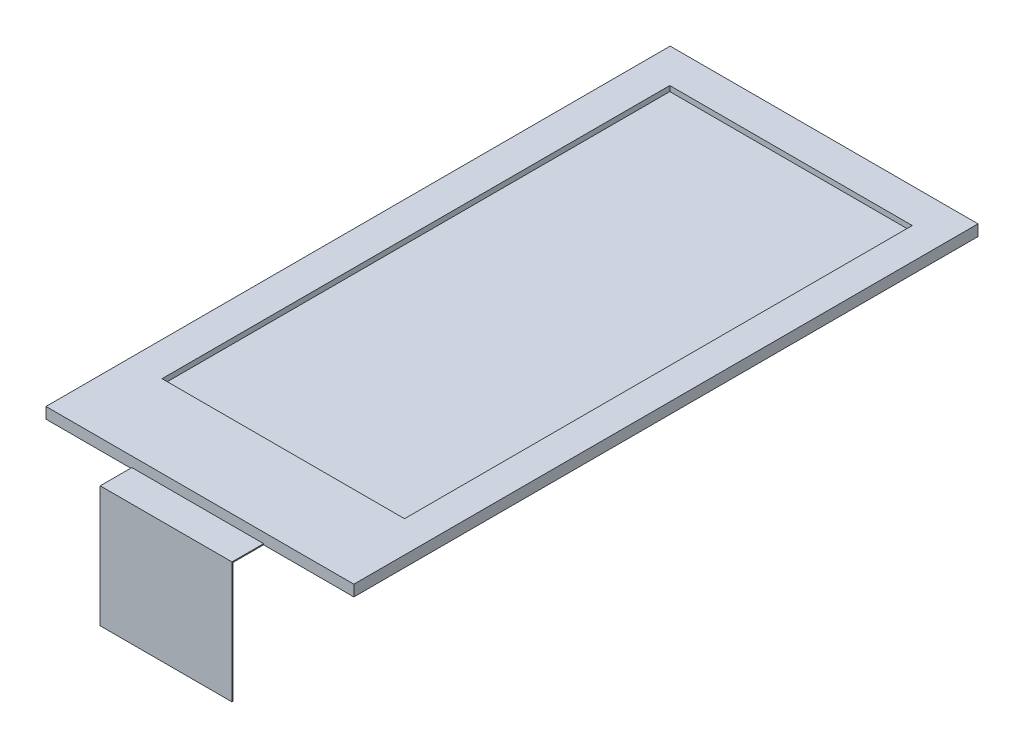
ISO-10303-21;
HEADER;
FILE_DESCRIPTION(('STEP AP214'),'2;1');
FILE_NAME('part.step','',(''),(''),'','','');
FILE_SCHEMA(('AUTOMOTIVE_DESIGN { 1 0 10303 214 1 1 1 1 }'));
ENDSEC;
DATA;
#1=APPLICATION_CONTEXT('core data for automotive mechanical design processes');
#2=APPLICATION_PROTOCOL_DEFINITION('international standard','automotive_design',2000,#1);
#3=PRODUCT_CONTEXT('',#1,'mechanical');
#4=PRODUCT('Part','Part','',(#3));
#5=PRODUCT_RELATED_PRODUCT_CATEGORY('part','',(#4));
#6=PRODUCT_DEFINITION_FORMATION('','',#4);
#7=PRODUCT_DEFINITION_CONTEXT('part definition',#1,'design');
#8=PRODUCT_DEFINITION('design','',#6,#7);
#9=PRODUCT_DEFINITION_SHAPE('','',#8);
#10=(LENGTH_UNIT() NAMED_UNIT(*) SI_UNIT(.MILLI.,.METRE.));
#11=(NAMED_UNIT(*) PLANE_ANGLE_UNIT() SI_UNIT($,.RADIAN.));
#12=(NAMED_UNIT(*) SI_UNIT($,.STERADIAN.) SOLID_ANGLE_UNIT());
#13=UNCERTAINTY_MEASURE_WITH_UNIT(LENGTH_MEASURE(1.E-05),#10,'distance_accuracy_value','');
#14=(GEOMETRIC_REPRESENTATION_CONTEXT(3) GLOBAL_UNCERTAINTY_ASSIGNED_CONTEXT((#13)) GLOBAL_UNIT_ASSIGNED_CONTEXT((#10,
#11,#12)) REPRESENTATION_CONTEXT('',''));
#15=CARTESIAN_POINT('',(0.,0.,0.));
#16=DIRECTION('',(0.,0.,1.));
#17=DIRECTION('',(1.,0.,0.));
#18=AXIS2_PLACEMENT_3D('',#15,#16,#17);
#19=CARTESIAN_POINT('',(0.,1.6,0.));
#20=DIRECTION('',(0.,-1.,0.));
#21=DIRECTION('',(0.,0.,-1.));
#22=AXIS2_PLACEMENT_3D('',#19,#20,#21);
#23=PLANE('',#22);
#24=DIRECTION('',(0.,0.,1.));
#25=VECTOR('',#24,1.);
#26=CARTESIAN_POINT('',(8.64,1.6,62.1));
#27=LINE('',#26,#25);
#28=CARTESIAN_POINT('',(8.64,1.6,62.1));
#29=VERTEX_POINT('',#28);
#30=CARTESIAN_POINT('',(8.64,1.6,65.1));
#31=VERTEX_POINT('',#30);
#32=EDGE_CURVE('E204',#29,#31,#27,.T.);
#33=ORIENTED_EDGE('',*,*,#32,.T.);
#34=DIRECTION('',(1.,0.,0.));
#35=VECTOR('',#34,1.);
#36=CARTESIAN_POINT('',(0.,1.6,65.1));
#37=LINE('',#36,#35);
#38=CARTESIAN_POINT('',(21.14,1.6,65.1));
#39=VERTEX_POINT('',#38);
#40=EDGE_CURVE('E179',#31,#39,#37,.T.);
#41=ORIENTED_EDGE('',*,*,#40,.T.);
#42=DIRECTION('',(0.,0.,-1.));
#43=VECTOR('',#42,1.);
#44=CARTESIAN_POINT('',(21.14,1.6,62.1));
#45=LINE('',#44,#43);
#46=CARTESIAN_POINT('',(21.14,1.6,62.1));
#47=VERTEX_POINT('',#46);
#48=EDGE_CURVE('E58',#39,#47,#45,.T.);
#49=ORIENTED_EDGE('',*,*,#48,.T.);
#50=DIRECTION('',(-1.,0.,0.));
#51=VECTOR('',#50,1.);
#52=CARTESIAN_POINT('',(21.14,1.6,62.1));
#53=LINE('',#52,#51);
#54=EDGE_CURVE('E201',#47,#29,#53,.T.);
#55=ORIENTED_EDGE('',*,*,#54,.T.);
#56=EDGE_LOOP('',(#33,#41,#49,#55));
#57=FACE_BOUND('',#56,.T.);
#58=ADVANCED_FACE('F35',(#57),#23,.F.);
#59=CARTESIAN_POINT('',(0.499999999999999,2.55,62.1));
#60=DIRECTION('',(0.,0.,-1.));
#61=DIRECTION('',(-1.,0.,0.));
#62=AXIS2_PLACEMENT_3D('',#59,#60,#61);
#63=PLANE('',#62);
#64=DIRECTION('',(0.,-1.,0.));
#65=VECTOR('',#64,1.);
#66=CARTESIAN_POINT('',(21.14,1.6,62.1));
#67=LINE('',#66,#65);
#68=CARTESIAN_POINT('',(21.14,1.5,62.1));
#69=VERTEX_POINT('',#68);
#70=EDGE_CURVE('E214',#47,#69,#67,.T.);
#71=ORIENTED_EDGE('',*,*,#70,.T.);
#72=DIRECTION('',(1.,0.,0.));
#73=VECTOR('',#72,1.);
#74=CARTESIAN_POINT('',(0.499999999999999,1.5,62.1));
#75=LINE('',#74,#73);
#76=CARTESIAN_POINT('',(29.7,1.5,62.1));
#77=VERTEX_POINT('',#76);
#78=EDGE_CURVE('E231',#69,#77,#75,.T.);
#79=ORIENTED_EDGE('',*,*,#78,.T.);
#80=DIRECTION('',(0.,-1.,0.));
#81=VECTOR('',#80,1.);
#82=CARTESIAN_POINT('',(29.7,2.55,62.1));
#83=LINE('',#82,#81);
#84=CARTESIAN_POINT('',(29.7,2.55,62.1));
#85=VERTEX_POINT('',#84);
#86=EDGE_CURVE('E43',#85,#77,#83,.T.);
#87=ORIENTED_EDGE('',*,*,#86,.F.);
#88=DIRECTION('',(1.,0.,0.));
#89=VECTOR('',#88,1.);
#90=CARTESIAN_POINT('',(0.499999999999999,2.55,62.1));
#91=LINE('',#90,#89);
#92=CARTESIAN_POINT('',(0.499999999999999,2.55,62.1));
#93=VERTEX_POINT('',#92);
#94=EDGE_CURVE('E221',#93,#85,#91,.T.);
#95=ORIENTED_EDGE('',*,*,#94,.F.);
#96=DIRECTION('',(0.,-1.,0.));
#97=VECTOR('',#96,1.);
#98=CARTESIAN_POINT('',(0.499999999999999,2.55,62.1));
#99=LINE('',#98,#97);
#100=CARTESIAN_POINT('',(0.499999999999999,1.5,62.1));
#101=VERTEX_POINT('',#100);
#102=EDGE_CURVE('E11',#93,#101,#99,.T.);
#103=ORIENTED_EDGE('',*,*,#102,.T.);
#104=CARTESIAN_POINT('',(8.64,1.5,62.1));
#105=VERTEX_POINT('',#104);
#106=EDGE_CURVE('E232',#101,#105,#75,.T.);
#107=ORIENTED_EDGE('',*,*,#106,.T.);
#108=DIRECTION('',(0.,-1.,0.));
#109=VECTOR('',#108,1.);
#110=CARTESIAN_POINT('',(8.64,1.6,62.1));
#111=LINE('',#110,#109);
#112=EDGE_CURVE('E207',#29,#105,#111,.T.);
#113=ORIENTED_EDGE('',*,*,#112,.F.);
#114=ORIENTED_EDGE('',*,*,#54,.F.);
#115=EDGE_LOOP('',(#71,#79,#87,#95,#103,#107,#113,#114));
#116=FACE_BOUND('',#115,.T.);
#117=ADVANCED_FACE('F252',(#116),#63,.F.);
#118=CARTESIAN_POINT('',(0.499999999999995,2.55,2.9));
#119=DIRECTION('',(1.,0.,0.));
#120=DIRECTION('',(0.,0.,-1.));
#121=AXIS2_PLACEMENT_3D('',#118,#119,#120);
#122=PLANE('',#121);
#123=DIRECTION('',(0.,0.,1.));
#124=VECTOR('',#123,1.);
#125=CARTESIAN_POINT('',(0.499999999999995,1.5,2.9));
#126=LINE('',#125,#124);
#127=CARTESIAN_POINT('',(0.499999999999995,1.5,2.9));
#128=VERTEX_POINT('',#127);
#129=EDGE_CURVE('E217',#128,#101,#126,.T.);
#130=ORIENTED_EDGE('',*,*,#129,.T.);
#131=ORIENTED_EDGE('',*,*,#102,.F.);
#132=DIRECTION('',(0.,0.,1.));
#133=VECTOR('',#132,1.);
#134=CARTESIAN_POINT('',(0.499999999999995,2.55,2.9));
#135=LINE('',#134,#133);
#136=CARTESIAN_POINT('',(0.499999999999995,2.55,2.9));
#137=VERTEX_POINT('',#136);
#138=EDGE_CURVE('E218',#137,#93,#135,.T.);
#139=ORIENTED_EDGE('',*,*,#138,.F.);
#140=DIRECTION('',(0.,-1.,0.));
#141=VECTOR('',#140,1.);
#142=CARTESIAN_POINT('',(0.499999999999995,2.55,2.9));
#143=LINE('',#142,#141);
#144=EDGE_CURVE('E228',#137,#128,#143,.T.);
#145=ORIENTED_EDGE('',*,*,#144,.T.);
#146=EDGE_LOOP('',(#130,#131,#139,#145));
#147=FACE_BOUND('',#146,.T.);
#148=ADVANCED_FACE('F37',(#147),#122,.F.);
#149=CARTESIAN_POINT('',(29.7,2.55,2.9));
#150=DIRECTION('',(-1.,0.,0.));
#151=DIRECTION('',(0.,0.,1.));
#152=AXIS2_PLACEMENT_3D('',#149,#150,#151);
#153=PLANE('',#152);
#154=DIRECTION('',(0.,0.,-1.));
#155=VECTOR('',#154,1.);
#156=CARTESIAN_POINT('',(29.7,1.5,2.9));
#157=LINE('',#156,#155);
#158=CARTESIAN_POINT('',(29.7,1.5,2.9));
#159=VERTEX_POINT('',#158);
#160=EDGE_CURVE('E235',#77,#159,#157,.T.);
#161=ORIENTED_EDGE('',*,*,#160,.T.);
#162=DIRECTION('',(0.,-1.,0.));
#163=VECTOR('',#162,1.);
#164=CARTESIAN_POINT('',(29.7,2.55,2.9));
#165=LINE('',#164,#163);
#166=CARTESIAN_POINT('',(29.7,2.55,2.9));
#167=VERTEX_POINT('',#166);
#168=EDGE_CURVE('E242',#167,#159,#165,.T.);
#169=ORIENTED_EDGE('',*,*,#168,.F.);
#170=DIRECTION('',(0.,0.,-1.));
#171=VECTOR('',#170,1.);
#172=CARTESIAN_POINT('',(29.7,2.55,2.9));
#173=LINE('',#172,#171);
#174=EDGE_CURVE('E224',#85,#167,#173,.T.);
#175=ORIENTED_EDGE('',*,*,#174,.F.);
#176=ORIENTED_EDGE('',*,*,#86,.T.);
#177=EDGE_LOOP('',(#161,#169,#175,#176));
#178=FACE_BOUND('',#177,.T.);
#179=ADVANCED_FACE('F248',(#178),#153,.F.);
#180=CARTESIAN_POINT('',(0.499999999999995,2.55,2.9));
#181=DIRECTION('',(0.,0.,1.));
#182=DIRECTION('',(1.,0.,0.));
#183=AXIS2_PLACEMENT_3D('',#180,#181,#182);
#184=PLANE('',#183);
#185=DIRECTION('',(-1.,0.,0.));
#186=VECTOR('',#185,1.);
#187=CARTESIAN_POINT('',(0.499999999999995,1.5,2.9));
#188=LINE('',#187,#186);
#189=EDGE_CURVE('E222',#159,#128,#188,.T.);
#190=ORIENTED_EDGE('',*,*,#189,.T.);
#191=ORIENTED_EDGE('',*,*,#144,.F.);
#192=DIRECTION('',(-1.,0.,0.));
#193=VECTOR('',#192,1.);
#194=CARTESIAN_POINT('',(0.499999999999995,2.55,2.9));
#195=LINE('',#194,#193);
#196=EDGE_CURVE('E226',#167,#137,#195,.T.);
#197=ORIENTED_EDGE('',*,*,#196,.F.);
#198=ORIENTED_EDGE('',*,*,#168,.T.);
#199=EDGE_LOOP('',(#190,#191,#197,#198));
#200=FACE_BOUND('',#199,.T.);
#201=ADVANCED_FACE('F261',(#200),#184,.F.);
#202=CARTESIAN_POINT('',(0.,2.55,0.));
#203=DIRECTION('',(0.,1.,0.));
#204=DIRECTION('',(0.,0.,1.));
#205=AXIS2_PLACEMENT_3D('',#202,#203,#204);
#206=PLANE('',#205);
#207=DIRECTION('',(0.,0.,1.));
#208=VECTOR('',#207,1.);
#209=CARTESIAN_POINT('',(3.72170232398616,2.55,54.3176233946099));
#210=LINE('',#209,#208);
#211=CARTESIAN_POINT('',(3.72170232398616,2.55,6.15565598195644));
#212=VERTEX_POINT('',#211);
#213=CARTESIAN_POINT('',(3.72170232398616,2.55,54.3176233946099));
#214=VERTEX_POINT('',#213);
#215=EDGE_CURVE('E50',#212,#214,#210,.T.);
#216=ORIENTED_EDGE('',*,*,#215,.F.);
#217=DIRECTION('',(-1.,0.,0.));
#218=VECTOR('',#217,1.);
#219=CARTESIAN_POINT('',(3.72170232398616,2.55,6.15565598195644));
#220=LINE('',#219,#218);
#221=CARTESIAN_POINT('',(26.7226222247245,2.55,6.15565598195644));
#222=VERTEX_POINT('',#221);
#223=EDGE_CURVE('E158',#222,#212,#220,.T.);
#224=ORIENTED_EDGE('',*,*,#223,.F.);
#225=DIRECTION('',(0.,0.,-1.));
#226=VECTOR('',#225,1.);
#227=CARTESIAN_POINT('',(26.7226222247245,2.55,54.3176233946099));
#228=LINE('',#227,#226);
#229=CARTESIAN_POINT('',(26.7226222247245,2.55,54.3176233946099));
#230=VERTEX_POINT('',#229);
#231=EDGE_CURVE('E161',#230,#222,#228,.T.);
#232=ORIENTED_EDGE('',*,*,#231,.F.);
#233=DIRECTION('',(1.,0.,0.));
#234=VECTOR('',#233,1.);
#235=CARTESIAN_POINT('',(3.72170232398616,2.55,54.3176233946099));
#236=LINE('',#235,#234);
#237=EDGE_CURVE('E167',#214,#230,#236,.T.);
#238=ORIENTED_EDGE('',*,*,#237,.F.);
#239=EDGE_LOOP('',(#216,#224,#232,#238));
#240=FACE_BOUND('',#239,.T.);
#241=ORIENTED_EDGE('',*,*,#138,.T.);
#242=ORIENTED_EDGE('',*,*,#94,.T.);
#243=ORIENTED_EDGE('',*,*,#174,.T.);
#244=ORIENTED_EDGE('',*,*,#196,.T.);
#245=EDGE_LOOP('',(#241,#242,#243,#244));
#246=FACE_BOUND('',#245,.T.);
#247=ADVANCED_FACE('F264',(#240,#246),#206,.T.);
#248=CARTESIAN_POINT('',(21.14,1.6,62.1));
#249=DIRECTION('',(-1.,0.,0.));
#250=DIRECTION('',(0.,0.,1.));
#251=AXIS2_PLACEMENT_3D('',#248,#249,#250);
#252=PLANE('',#251);
#253=ORIENTED_EDGE('',*,*,#48,.F.);
#254=DIRECTION('',(0.,1.,0.));
#255=VECTOR('',#254,1.);
#256=CARTESIAN_POINT('',(21.14,1.5,65.1));
#257=LINE('',#256,#255);
#258=CARTESIAN_POINT('',(21.14,-9.9,65.1));
#259=VERTEX_POINT('',#258);
#260=EDGE_CURVE('E182',#259,#39,#257,.T.);
#261=ORIENTED_EDGE('',*,*,#260,.F.);
#262=DIRECTION('',(0.,0.,-1.));
#263=VECTOR('',#262,1.);
#264=CARTESIAN_POINT('',(21.14,-9.9,65.1));
#265=LINE('',#264,#263);
#266=CARTESIAN_POINT('',(21.14,-9.9,65.));
#267=VERTEX_POINT('',#266);
#268=EDGE_CURVE('E189',#259,#267,#265,.T.);
#269=ORIENTED_EDGE('',*,*,#268,.T.);
#270=DIRECTION('',(0.,1.,0.));
#271=VECTOR('',#270,1.);
#272=CARTESIAN_POINT('',(21.14,1.5,65.));
#273=LINE('',#272,#271);
#274=CARTESIAN_POINT('',(21.14,1.5,65.));
#275=VERTEX_POINT('',#274);
#276=EDGE_CURVE('E181',#267,#275,#273,.T.);
#277=ORIENTED_EDGE('',*,*,#276,.T.);
#278=DIRECTION('',(0.,0.,-1.));
#279=VECTOR('',#278,1.);
#280=CARTESIAN_POINT('',(21.14,1.5,62.1));
#281=LINE('',#280,#279);
#282=EDGE_CURVE('E199',#275,#69,#281,.T.);
#283=ORIENTED_EDGE('',*,*,#282,.T.);
#284=ORIENTED_EDGE('',*,*,#70,.F.);
#285=EDGE_LOOP('',(#253,#261,#269,#277,#283,#284));
#286=FACE_BOUND('',#285,.T.);
#287=ADVANCED_FACE('F273',(#286),#252,.F.);
#288=CARTESIAN_POINT('',(8.64,1.6,62.1));
#289=DIRECTION('',(1.,0.,0.));
#290=DIRECTION('',(0.,0.,-1.));
#291=AXIS2_PLACEMENT_3D('',#288,#289,#290);
#292=PLANE('',#291);
#293=DIRECTION('',(0.,-1.,0.));
#294=VECTOR('',#293,1.);
#295=CARTESIAN_POINT('',(8.64,1.5,65.1));
#296=LINE('',#295,#294);
#297=CARTESIAN_POINT('',(8.64,-9.9,65.1));
#298=VERTEX_POINT('',#297);
#299=EDGE_CURVE('E184',#31,#298,#296,.T.);
#300=ORIENTED_EDGE('',*,*,#299,.F.);
#301=ORIENTED_EDGE('',*,*,#32,.F.);
#302=ORIENTED_EDGE('',*,*,#112,.T.);
#303=DIRECTION('',(0.,0.,1.));
#304=VECTOR('',#303,1.);
#305=CARTESIAN_POINT('',(8.64,1.5,62.1));
#306=LINE('',#305,#304);
#307=CARTESIAN_POINT('',(8.64,1.5,65.));
#308=VERTEX_POINT('',#307);
#309=EDGE_CURVE('E202',#105,#308,#306,.T.);
#310=ORIENTED_EDGE('',*,*,#309,.T.);
#311=DIRECTION('',(0.,-1.,0.));
#312=VECTOR('',#311,1.);
#313=CARTESIAN_POINT('',(8.64,1.5,65.));
#314=LINE('',#313,#312);
#315=CARTESIAN_POINT('',(8.64,-9.9,65.));
#316=VERTEX_POINT('',#315);
#317=EDGE_CURVE('E191',#308,#316,#314,.T.);
#318=ORIENTED_EDGE('',*,*,#317,.T.);
#319=DIRECTION('',(0.,0.,-1.));
#320=VECTOR('',#319,1.);
#321=CARTESIAN_POINT('',(8.64,-9.9,65.1));
#322=LINE('',#321,#320);
#323=EDGE_CURVE('E196',#298,#316,#322,.T.);
#324=ORIENTED_EDGE('',*,*,#323,.F.);
#325=EDGE_LOOP('',(#300,#301,#302,#310,#318,#324));
#326=FACE_BOUND('',#325,.T.);
#327=ADVANCED_FACE('F269',(#326),#292,.F.);
#328=CARTESIAN_POINT('',(0.,0.,65.));
#329=DIRECTION('',(0.,0.,-1.));
#330=DIRECTION('',(-1.,0.,0.));
#331=AXIS2_PLACEMENT_3D('',#328,#329,#330);
#332=PLANE('',#331);
#333=DIRECTION('',(1.,0.,0.));
#334=VECTOR('',#333,1.);
#335=CARTESIAN_POINT('',(21.14,-9.9,65.));
#336=LINE('',#335,#334);
#337=EDGE_CURVE('E185',#316,#267,#336,.T.);
#338=ORIENTED_EDGE('',*,*,#337,.F.);
#339=ORIENTED_EDGE('',*,*,#317,.F.);
#340=DIRECTION('',(-1.,0.,0.));
#341=VECTOR('',#340,1.);
#342=CARTESIAN_POINT('',(8.64,1.5,65.));
#343=LINE('',#342,#341);
#344=EDGE_CURVE('E173',#275,#308,#343,.T.);
#345=ORIENTED_EDGE('',*,*,#344,.F.);
#346=ORIENTED_EDGE('',*,*,#276,.F.);
#347=EDGE_LOOP('',(#338,#339,#345,#346));
#348=FACE_BOUND('',#347,.T.);
#349=ADVANCED_FACE('F279',(#348),#332,.T.);
#350=CARTESIAN_POINT('',(21.14,-9.9,65.1));
#351=DIRECTION('',(0.,1.,0.));
#352=DIRECTION('',(-1.,0.,0.));
#353=AXIS2_PLACEMENT_3D('',#350,#351,#352);
#354=PLANE('',#353);
#355=ORIENTED_EDGE('',*,*,#337,.T.);
#356=ORIENTED_EDGE('',*,*,#268,.F.);
#357=DIRECTION('',(1.,0.,0.));
#358=VECTOR('',#357,1.);
#359=CARTESIAN_POINT('',(21.14,-9.9,65.1));
#360=LINE('',#359,#358);
#361=EDGE_CURVE('E187',#298,#259,#360,.T.);
#362=ORIENTED_EDGE('',*,*,#361,.F.);
#363=ORIENTED_EDGE('',*,*,#323,.T.);
#364=EDGE_LOOP('',(#355,#356,#362,#363));
#365=FACE_BOUND('',#364,.T.);
#366=ADVANCED_FACE('F282',(#365),#354,.F.);
#367=CARTESIAN_POINT('',(0.,0.,65.1));
#368=DIRECTION('',(0.,0.,-1.));
#369=DIRECTION('',(-1.,0.,0.));
#370=AXIS2_PLACEMENT_3D('',#367,#368,#369);
#371=PLANE('',#370);
#372=ORIENTED_EDGE('',*,*,#260,.T.);
#373=ORIENTED_EDGE('',*,*,#40,.F.);
#374=ORIENTED_EDGE('',*,*,#299,.T.);
#375=ORIENTED_EDGE('',*,*,#361,.T.);
#376=EDGE_LOOP('',(#372,#373,#374,#375));
#377=FACE_BOUND('',#376,.T.);
#378=ADVANCED_FACE('F284',(#377),#371,.F.);
#379=CARTESIAN_POINT('',(3.25000000000001,1.5,61.75));
#380=DIRECTION('',(0.,1.,0.));
#381=DIRECTION('',(0.,0.,1.));
#382=AXIS2_PLACEMENT_3D('',#379,#380,#381);
#383=PLANE('',#382);
#384=ORIENTED_EDGE('',*,*,#344,.T.);
#385=ORIENTED_EDGE('',*,*,#309,.F.);
#386=ORIENTED_EDGE('',*,*,#106,.F.);
#387=ORIENTED_EDGE('',*,*,#129,.F.);
#388=ORIENTED_EDGE('',*,*,#189,.F.);
#389=ORIENTED_EDGE('',*,*,#160,.F.);
#390=ORIENTED_EDGE('',*,*,#78,.F.);
#391=ORIENTED_EDGE('',*,*,#282,.F.);
#392=EDGE_LOOP('',(#384,#385,#386,#387,#388,#389,#390,#391));
#393=FACE_BOUND('',#392,.T.);
#394=ADVANCED_FACE('F256',(#393),#383,.F.);
#395=CARTESIAN_POINT('',(3.72170232398616,2.05,54.3176233946099));
#396=DIRECTION('',(-1.,0.,0.));
#397=DIRECTION('',(0.,0.,1.));
#398=AXIS2_PLACEMENT_3D('',#395,#396,#397);
#399=PLANE('',#398);
#400=ORIENTED_EDGE('',*,*,#215,.T.);
#401=DIRECTION('',(0.,1.,0.));
#402=VECTOR('',#401,1.);
#403=CARTESIAN_POINT('',(3.72170232398616,2.05,54.3176233946099));
#404=LINE('',#403,#402);
#405=CARTESIAN_POINT('',(3.72170232398616,2.05,54.3176233946099));
#406=VERTEX_POINT('',#405);
#407=EDGE_CURVE('E136',#406,#214,#404,.T.);
#408=ORIENTED_EDGE('',*,*,#407,.F.);
#409=DIRECTION('',(0.,0.,1.));
#410=VECTOR('',#409,1.);
#411=CARTESIAN_POINT('',(3.72170232398616,2.05,54.3176233946099));
#412=LINE('',#411,#410);
#413=CARTESIAN_POINT('',(3.72170232398616,2.05,6.15565598195644));
#414=VERTEX_POINT('',#413);
#415=EDGE_CURVE('E140',#414,#406,#412,.T.);
#416=ORIENTED_EDGE('',*,*,#415,.F.);
#417=DIRECTION('',(0.,1.,0.));
#418=VECTOR('',#417,1.);
#419=CARTESIAN_POINT('',(3.72170232398616,2.05,6.15565598195644));
#420=LINE('',#419,#418);
#421=EDGE_CURVE('E171',#414,#212,#420,.T.);
#422=ORIENTED_EDGE('',*,*,#421,.T.);
#423=EDGE_LOOP('',(#400,#408,#416,#422));
#424=FACE_BOUND('',#423,.T.);
#425=ADVANCED_FACE('F138',(#424),#399,.F.);
#426=CARTESIAN_POINT('',(3.72170232398616,2.05,6.15565598195644));
#427=DIRECTION('',(0.,0.,-1.));
#428=DIRECTION('',(-1.,0.,0.));
#429=AXIS2_PLACEMENT_3D('',#426,#427,#428);
#430=PLANE('',#429);
#431=ORIENTED_EDGE('',*,*,#223,.T.);
#432=ORIENTED_EDGE('',*,*,#421,.F.);
#433=DIRECTION('',(-1.,0.,0.));
#434=VECTOR('',#433,1.);
#435=CARTESIAN_POINT('',(3.72170232398616,2.05,6.15565598195644));
#436=LINE('',#435,#434);
#437=CARTESIAN_POINT('',(26.7226222247245,2.05,6.15565598195644));
#438=VERTEX_POINT('',#437);
#439=EDGE_CURVE('E146',#438,#414,#436,.T.);
#440=ORIENTED_EDGE('',*,*,#439,.F.);
#441=DIRECTION('',(0.,1.,0.));
#442=VECTOR('',#441,1.);
#443=CARTESIAN_POINT('',(26.7226222247245,2.05,6.15565598195644));
#444=LINE('',#443,#442);
#445=EDGE_CURVE('E174',#438,#222,#444,.T.);
#446=ORIENTED_EDGE('',*,*,#445,.T.);
#447=EDGE_LOOP('',(#431,#432,#440,#446));
#448=FACE_BOUND('',#447,.T.);
#449=ADVANCED_FACE('F384',(#448),#430,.F.);
#450=CARTESIAN_POINT('',(26.7226222247245,2.05,54.3176233946099));
#451=DIRECTION('',(1.,0.,0.));
#452=DIRECTION('',(0.,0.,-1.));
#453=AXIS2_PLACEMENT_3D('',#450,#451,#452);
#454=PLANE('',#453);
#455=ORIENTED_EDGE('',*,*,#231,.T.);
#456=ORIENTED_EDGE('',*,*,#445,.F.);
#457=DIRECTION('',(0.,0.,-1.));
#458=VECTOR('',#457,1.);
#459=CARTESIAN_POINT('',(26.7226222247245,2.05,54.3176233946099));
#460=LINE('',#459,#458);
#461=CARTESIAN_POINT('',(26.7226222247245,2.05,54.3176233946099));
#462=VERTEX_POINT('',#461);
#463=EDGE_CURVE('E154',#462,#438,#460,.T.);
#464=ORIENTED_EDGE('',*,*,#463,.F.);
#465=DIRECTION('',(0.,1.,0.));
#466=VECTOR('',#465,1.);
#467=CARTESIAN_POINT('',(26.7226222247245,2.05,54.3176233946099));
#468=LINE('',#467,#466);
#469=EDGE_CURVE('E145',#462,#230,#468,.T.);
#470=ORIENTED_EDGE('',*,*,#469,.T.);
#471=EDGE_LOOP('',(#455,#456,#464,#470));
#472=FACE_BOUND('',#471,.T.);
#473=ADVANCED_FACE('F393',(#472),#454,.F.);
#474=CARTESIAN_POINT('',(3.72170232398616,2.05,54.3176233946099));
#475=DIRECTION('',(0.,0.,1.));
#476=DIRECTION('',(1.,0.,0.));
#477=AXIS2_PLACEMENT_3D('',#474,#475,#476);
#478=PLANE('',#477);
#479=ORIENTED_EDGE('',*,*,#237,.T.);
#480=ORIENTED_EDGE('',*,*,#469,.F.);
#481=DIRECTION('',(1.,0.,0.));
#482=VECTOR('',#481,1.);
#483=CARTESIAN_POINT('',(3.72170232398616,2.05,54.3176233946099));
#484=LINE('',#483,#482);
#485=EDGE_CURVE('E149',#406,#462,#484,.T.);
#486=ORIENTED_EDGE('',*,*,#485,.F.);
#487=ORIENTED_EDGE('',*,*,#407,.T.);
#488=EDGE_LOOP('',(#479,#480,#486,#487));
#489=FACE_BOUND('',#488,.T.);
#490=ADVANCED_FACE('F150',(#489),#478,.F.);
#491=CARTESIAN_POINT('',(0.,2.05,0.));
#492=DIRECTION('',(0.,-1.,0.));
#493=DIRECTION('',(0.,0.,-1.));
#494=AXIS2_PLACEMENT_3D('',#491,#492,#493);
#495=PLANE('',#494);
#496=ORIENTED_EDGE('',*,*,#415,.T.);
#497=ORIENTED_EDGE('',*,*,#485,.T.);
#498=ORIENTED_EDGE('',*,*,#463,.T.);
#499=ORIENTED_EDGE('',*,*,#439,.T.);
#500=EDGE_LOOP('',(#496,#497,#498,#499));
#501=FACE_BOUND('',#500,.T.);
#502=ADVANCED_FACE('F156',(#501),#495,.F.);
#503=CLOSED_SHELL('',(#58,#117,#148,#179,#201,#247,#287,#327,#349,#366,#378,#394,#425,#449,#473,
#490,#502));
#504=MANIFOLD_SOLID_BREP('B2',#503);
#505=ADVANCED_BREP_SHAPE_REPRESENTATION('',(#18,#504),#14);
#506=SHAPE_DEFINITION_REPRESENTATION(#9,#505);
ENDSEC;
END-ISO-10303-21;
